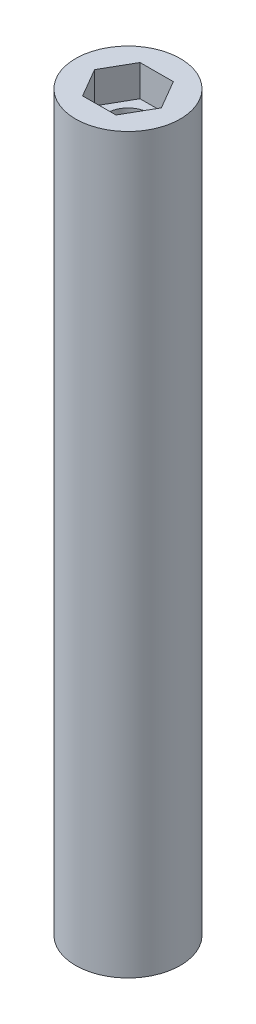
ISO-10303-21;
HEADER;
FILE_DESCRIPTION(('STEP AP214'),'2;1');
FILE_NAME('part.step','',(''),(''),'','','');
FILE_SCHEMA(('AUTOMOTIVE_DESIGN { 1 0 10303 214 1 1 1 1 }'));
ENDSEC;
DATA;
#1=APPLICATION_CONTEXT('core data for automotive mechanical design processes');
#2=APPLICATION_PROTOCOL_DEFINITION('international standard','automotive_design',2000,#1);
#3=PRODUCT_CONTEXT('',#1,'mechanical');
#4=PRODUCT('Part','Part','',(#3));
#5=PRODUCT_RELATED_PRODUCT_CATEGORY('part','',(#4));
#6=PRODUCT_DEFINITION_FORMATION('','',#4);
#7=PRODUCT_DEFINITION_CONTEXT('part definition',#1,'design');
#8=PRODUCT_DEFINITION('design','',#6,#7);
#9=PRODUCT_DEFINITION_SHAPE('','',#8);
#10=(LENGTH_UNIT() NAMED_UNIT(*) SI_UNIT(.MILLI.,.METRE.));
#11=(NAMED_UNIT(*) PLANE_ANGLE_UNIT() SI_UNIT($,.RADIAN.));
#12=(NAMED_UNIT(*) SI_UNIT($,.STERADIAN.) SOLID_ANGLE_UNIT());
#13=UNCERTAINTY_MEASURE_WITH_UNIT(LENGTH_MEASURE(1.E-05),#10,'distance_accuracy_value','');
#14=(GEOMETRIC_REPRESENTATION_CONTEXT(3) GLOBAL_UNCERTAINTY_ASSIGNED_CONTEXT((#13)) GLOBAL_UNIT_ASSIGNED_CONTEXT((#10,
#11,#12)) REPRESENTATION_CONTEXT('',''));
#15=CARTESIAN_POINT('',(0.,0.,0.));
#16=DIRECTION('',(0.,0.,1.));
#17=DIRECTION('',(1.,0.,0.));
#18=AXIS2_PLACEMENT_3D('',#15,#16,#17);
#19=CARTESIAN_POINT('',(0.,0.,0.));
#20=DIRECTION('',(0.,1.,0.));
#21=DIRECTION('',(0.,0.,1.));
#22=AXIS2_PLACEMENT_3D('',#19,#20,#21);
#23=CYLINDRICAL_SURFACE('',#22,2.);
#24=CARTESIAN_POINT('',(0.,3.,0.));
#25=DIRECTION('',(0.,1.,0.));
#26=DIRECTION('',(0.,0.,1.));
#27=AXIS2_PLACEMENT_3D('',#24,#25,#26);
#28=CIRCLE('',#27,2.);
#29=CARTESIAN_POINT('',(0.,3.,2.));
#30=VERTEX_POINT('',#29);
#31=EDGE_CURVE('E37',#30,#30,#28,.F.);
#32=ORIENTED_EDGE('',*,*,#31,.T.);
#33=EDGE_LOOP('',(#32));
#34=FACE_BOUND('',#33,.T.);
#35=CARTESIAN_POINT('',(0.,67.,0.));
#36=DIRECTION('',(0.,1.,0.));
#37=DIRECTION('',(0.,0.,1.));
#38=AXIS2_PLACEMENT_3D('',#35,#36,#37);
#39=CIRCLE('',#38,2.);
#40=CARTESIAN_POINT('',(0.,67.,2.));
#41=VERTEX_POINT('',#40);
#42=EDGE_CURVE('E217',#41,#41,#39,.F.);
#43=ORIENTED_EDGE('',*,*,#42,.F.);
#44=EDGE_LOOP('',(#43));
#45=FACE_BOUND('',#44,.T.);
#46=ADVANCED_FACE('F33',(#34,#45),#23,.F.);
#47=CARTESIAN_POINT('',(0.,70.,0.));
#48=DIRECTION('',(0.,-1.,0.));
#49=DIRECTION('',(0.,0.,-1.));
#50=AXIS2_PLACEMENT_3D('',#47,#48,#49);
#51=CYLINDRICAL_SURFACE('',#50,5.);
#52=CARTESIAN_POINT('',(0.,70.,0.));
#53=DIRECTION('',(0.,1.,0.));
#54=DIRECTION('',(0.,0.,1.));
#55=AXIS2_PLACEMENT_3D('',#52,#53,#54);
#56=CIRCLE('',#55,5.);
#57=CARTESIAN_POINT('',(0.,70.,5.));
#58=VERTEX_POINT('',#57);
#59=EDGE_CURVE('E11',#58,#58,#56,.T.);
#60=ORIENTED_EDGE('',*,*,#59,.F.);
#61=EDGE_LOOP('',(#60));
#62=FACE_BOUND('',#61,.T.);
#63=CARTESIAN_POINT('',(0.,0.,0.));
#64=DIRECTION('',(0.,1.,0.));
#65=DIRECTION('',(0.,0.,1.));
#66=AXIS2_PLACEMENT_3D('',#63,#64,#65);
#67=CIRCLE('',#66,5.);
#68=CARTESIAN_POINT('',(0.,0.,5.));
#69=VERTEX_POINT('',#68);
#70=EDGE_CURVE('E42',#69,#69,#67,.T.);
#71=ORIENTED_EDGE('',*,*,#70,.T.);
#72=EDGE_LOOP('',(#71));
#73=FACE_BOUND('',#72,.T.);
#74=ADVANCED_FACE('F35',(#62,#73),#51,.T.);
#75=CARTESIAN_POINT('',(0.,70.,0.));
#76=DIRECTION('',(0.,1.,0.));
#77=DIRECTION('',(0.,0.,1.));
#78=AXIS2_PLACEMENT_3D('',#75,#76,#77);
#79=PLANE('',#78);
#80=DIRECTION('',(0.99999151154788,0.,-0.00412029515770227));
#81=VECTOR('',#80,1.);
#82=CARTESIAN_POINT('',(-1.57636895135997,70.,2.75651850393238));
#83=LINE('',#82,#81);
#84=CARTESIAN_POINT('',(-1.57636895135997,70.,2.75651850393238));
#85=VERTEX_POINT('',#84);
#86=CARTESIAN_POINT('',(1.59903057472733,70.,2.74343480958096));
#87=VERTEX_POINT('',#86);
#88=EDGE_CURVE('E58',#85,#87,#83,.T.);
#89=ORIENTED_EDGE('',*,*,#88,.F.);
#90=DIRECTION('',(0.5035640360516,0.,0.863957904990413));
#91=VECTOR('',#90,1.);
#92=CARTESIAN_POINT('',(-3.1753995260873,70.,0.0130836943514207));
#93=LINE('',#92,#91);
#94=CARTESIAN_POINT('',(-3.1753995260873,70.,0.0130836943514207));
#95=VERTEX_POINT('',#94);
#96=EDGE_CURVE('E184',#95,#85,#93,.T.);
#97=ORIENTED_EDGE('',*,*,#96,.F.);
#98=DIRECTION('',(-0.496427475496279,0.,0.868078200148115));
#99=VECTOR('',#98,1.);
#100=CARTESIAN_POINT('',(-1.59903057472733,70.,-2.74343480958096));
#101=LINE('',#100,#99);
#102=CARTESIAN_POINT('',(-1.59903057472733,70.,-2.74343480958096));
#103=VERTEX_POINT('',#102);
#104=EDGE_CURVE('E210',#103,#95,#101,.T.);
#105=ORIENTED_EDGE('',*,*,#104,.F.);
#106=DIRECTION('',(-0.99999151154788,0.,0.00412029515770227));
#107=VECTOR('',#106,1.);
#108=CARTESIAN_POINT('',(1.57636895135997,70.,-2.75651850393238));
#109=LINE('',#108,#107);
#110=CARTESIAN_POINT('',(1.57636895135997,70.,-2.75651850393238));
#111=VERTEX_POINT('',#110);
#112=EDGE_CURVE('E207',#111,#103,#109,.T.);
#113=ORIENTED_EDGE('',*,*,#112,.F.);
#114=DIRECTION('',(-0.5035640360516,0.,-0.863957904990413));
#115=VECTOR('',#114,1.);
#116=CARTESIAN_POINT('',(3.1753995260873,70.,-0.0130836943514213));
#117=LINE('',#116,#115);
#118=CARTESIAN_POINT('',(3.1753995260873,70.,-0.0130836943514213));
#119=VERTEX_POINT('',#118);
#120=EDGE_CURVE('E204',#119,#111,#117,.T.);
#121=ORIENTED_EDGE('',*,*,#120,.F.);
#122=DIRECTION('',(0.496427475496279,0.,-0.868078200148115));
#123=VECTOR('',#122,1.);
#124=CARTESIAN_POINT('',(1.59903057472733,70.,2.74343480958096));
#125=LINE('',#124,#123);
#126=EDGE_CURVE('E201',#87,#119,#125,.T.);
#127=ORIENTED_EDGE('',*,*,#126,.F.);
#128=EDGE_LOOP('',(#89,#97,#105,#113,#121,#127));
#129=FACE_BOUND('',#128,.T.);
#130=ORIENTED_EDGE('',*,*,#59,.T.);
#131=EDGE_LOOP('',(#130));
#132=FACE_BOUND('',#131,.T.);
#133=ADVANCED_FACE('F239',(#129,#132),#79,.T.);
#134=CARTESIAN_POINT('',(0.,0.,0.));
#135=DIRECTION('',(0.,1.,0.));
#136=DIRECTION('',(0.,0.,1.));
#137=AXIS2_PLACEMENT_3D('',#134,#135,#136);
#138=PLANE('',#137);
#139=DIRECTION('',(0.5035640360516,0.,0.863957904990413));
#140=VECTOR('',#139,1.);
#141=CARTESIAN_POINT('',(-3.1753995260873,0.,0.0130836943514207));
#142=LINE('',#141,#140);
#143=CARTESIAN_POINT('',(-3.1753995260873,0.,0.0130836943514207));
#144=VERTEX_POINT('',#143);
#145=CARTESIAN_POINT('',(-1.57636895135997,0.,2.75651850393238));
#146=VERTEX_POINT('',#145);
#147=EDGE_CURVE('E136',#144,#146,#142,.T.);
#148=ORIENTED_EDGE('',*,*,#147,.T.);
#149=DIRECTION('',(0.99999151154788,0.,-0.00412029515770227));
#150=VECTOR('',#149,1.);
#151=CARTESIAN_POINT('',(-1.57636895135997,0.,2.75651850393238));
#152=LINE('',#151,#150);
#153=CARTESIAN_POINT('',(1.59903057472733,0.,2.74343480958096));
#154=VERTEX_POINT('',#153);
#155=EDGE_CURVE('E128',#146,#154,#152,.T.);
#156=ORIENTED_EDGE('',*,*,#155,.T.);
#157=DIRECTION('',(0.496427475496279,0.,-0.868078200148115));
#158=VECTOR('',#157,1.);
#159=CARTESIAN_POINT('',(1.59903057472733,0.,2.74343480958096));
#160=LINE('',#159,#158);
#161=CARTESIAN_POINT('',(3.1753995260873,0.,-0.0130836943514213));
#162=VERTEX_POINT('',#161);
#163=EDGE_CURVE('E139',#154,#162,#160,.T.);
#164=ORIENTED_EDGE('',*,*,#163,.T.);
#165=DIRECTION('',(-0.5035640360516,0.,-0.863957904990413));
#166=VECTOR('',#165,1.);
#167=CARTESIAN_POINT('',(3.1753995260873,0.,-0.0130836943514213));
#168=LINE('',#167,#166);
#169=CARTESIAN_POINT('',(1.57636895135997,0.,-2.75651850393238));
#170=VERTEX_POINT('',#169);
#171=EDGE_CURVE('E50',#162,#170,#168,.T.);
#172=ORIENTED_EDGE('',*,*,#171,.T.);
#173=DIRECTION('',(-0.99999151154788,0.,0.00412029515770227));
#174=VECTOR('',#173,1.);
#175=CARTESIAN_POINT('',(1.57636895135997,0.,-2.75651850393238));
#176=LINE('',#175,#174);
#177=CARTESIAN_POINT('',(-1.59903057472733,0.,-2.74343480958096));
#178=VERTEX_POINT('',#177);
#179=EDGE_CURVE('E154',#170,#178,#176,.T.);
#180=ORIENTED_EDGE('',*,*,#179,.T.);
#181=DIRECTION('',(-0.496427475496279,0.,0.868078200148115));
#182=VECTOR('',#181,1.);
#183=CARTESIAN_POINT('',(-1.59903057472733,0.,-2.74343480958096));
#184=LINE('',#183,#182);
#185=EDGE_CURVE('E157',#178,#144,#184,.T.);
#186=ORIENTED_EDGE('',*,*,#185,.T.);
#187=EDGE_LOOP('',(#148,#156,#164,#172,#180,#186));
#188=FACE_BOUND('',#187,.T.);
#189=ORIENTED_EDGE('',*,*,#70,.F.);
#190=EDGE_LOOP('',(#189));
#191=FACE_BOUND('',#190,.T.);
#192=ADVANCED_FACE('F143',(#188,#191),#138,.F.);
#193=CARTESIAN_POINT('',(0.,67.,0.));
#194=DIRECTION('',(0.,1.,0.));
#195=DIRECTION('',(0.,0.,1.));
#196=AXIS2_PLACEMENT_3D('',#193,#194,#195);
#197=PLANE('',#196);
#198=DIRECTION('',(0.99999151154788,0.,-0.00412029515770227));
#199=VECTOR('',#198,1.);
#200=CARTESIAN_POINT('',(-1.57636895135997,67.,2.75651850393238));
#201=LINE('',#200,#199);
#202=CARTESIAN_POINT('',(-1.57636895135997,67.,2.75651850393238));
#203=VERTEX_POINT('',#202);
#204=CARTESIAN_POINT('',(1.59903057472733,67.,2.74343480958096));
#205=VERTEX_POINT('',#204);
#206=EDGE_CURVE('E180',#203,#205,#201,.T.);
#207=ORIENTED_EDGE('',*,*,#206,.T.);
#208=DIRECTION('',(0.496427475496279,0.,-0.868078200148115));
#209=VECTOR('',#208,1.);
#210=CARTESIAN_POINT('',(1.59903057472733,67.,2.74343480958096));
#211=LINE('',#210,#209);
#212=CARTESIAN_POINT('',(3.1753995260873,67.,-0.0130836943514213));
#213=VERTEX_POINT('',#212);
#214=EDGE_CURVE('E183',#205,#213,#211,.T.);
#215=ORIENTED_EDGE('',*,*,#214,.T.);
#216=DIRECTION('',(-0.5035640360516,0.,-0.863957904990413));
#217=VECTOR('',#216,1.);
#218=CARTESIAN_POINT('',(3.1753995260873,67.,-0.0130836943514213));
#219=LINE('',#218,#217);
#220=CARTESIAN_POINT('',(1.57636895135997,67.,-2.75651850393238));
#221=VERTEX_POINT('',#220);
#222=EDGE_CURVE('E187',#213,#221,#219,.T.);
#223=ORIENTED_EDGE('',*,*,#222,.T.);
#224=DIRECTION('',(-0.99999151154788,0.,0.00412029515770227));
#225=VECTOR('',#224,1.);
#226=CARTESIAN_POINT('',(1.57636895135997,67.,-2.75651850393238));
#227=LINE('',#226,#225);
#228=CARTESIAN_POINT('',(-1.59903057472733,67.,-2.74343480958096));
#229=VERTEX_POINT('',#228);
#230=EDGE_CURVE('E190',#221,#229,#227,.T.);
#231=ORIENTED_EDGE('',*,*,#230,.T.);
#232=DIRECTION('',(-0.496427475496279,0.,0.868078200148115));
#233=VECTOR('',#232,1.);
#234=CARTESIAN_POINT('',(-1.59903057472733,67.,-2.74343480958096));
#235=LINE('',#234,#233);
#236=CARTESIAN_POINT('',(-3.1753995260873,67.,0.0130836943514207));
#237=VERTEX_POINT('',#236);
#238=EDGE_CURVE('E193',#229,#237,#235,.T.);
#239=ORIENTED_EDGE('',*,*,#238,.T.);
#240=DIRECTION('',(0.5035640360516,0.,0.863957904990413));
#241=VECTOR('',#240,1.);
#242=CARTESIAN_POINT('',(-3.1753995260873,67.,0.0130836943514207));
#243=LINE('',#242,#241);
#244=EDGE_CURVE('E196',#237,#203,#243,.T.);
#245=ORIENTED_EDGE('',*,*,#244,.T.);
#246=EDGE_LOOP('',(#207,#215,#223,#231,#239,#245));
#247=FACE_BOUND('',#246,.T.);
#248=ORIENTED_EDGE('',*,*,#42,.T.);
#249=EDGE_LOOP('',(#248));
#250=FACE_BOUND('',#249,.T.);
#251=ADVANCED_FACE('F231',(#247,#250),#197,.T.);
#252=CARTESIAN_POINT('',(-1.57636895135997,67.,2.75651850393238));
#253=DIRECTION('',(0.00412029515770227,0.,0.99999151154788));
#254=DIRECTION('',(0.99999151154788,0.,-0.00412029515770227));
#255=AXIS2_PLACEMENT_3D('',#252,#253,#254);
#256=PLANE('',#255);
#257=ORIENTED_EDGE('',*,*,#88,.T.);
#258=DIRECTION('',(0.,1.,0.));
#259=VECTOR('',#258,1.);
#260=CARTESIAN_POINT('',(1.59903057472733,67.,2.74343480958096));
#261=LINE('',#260,#259);
#262=EDGE_CURVE('E199',#205,#87,#261,.T.);
#263=ORIENTED_EDGE('',*,*,#262,.F.);
#264=ORIENTED_EDGE('',*,*,#206,.F.);
#265=DIRECTION('',(0.,1.,0.));
#266=VECTOR('',#265,1.);
#267=CARTESIAN_POINT('',(-1.57636895135997,67.,2.75651850393238));
#268=LINE('',#267,#266);
#269=EDGE_CURVE('E215',#203,#85,#268,.T.);
#270=ORIENTED_EDGE('',*,*,#269,.T.);
#271=EDGE_LOOP('',(#257,#263,#264,#270));
#272=FACE_BOUND('',#271,.T.);
#273=ADVANCED_FACE('F244',(#272),#256,.F.);
#274=CARTESIAN_POINT('',(-3.1753995260873,67.,0.0130836943514207));
#275=DIRECTION('',(-0.863957904990413,0.,0.5035640360516));
#276=DIRECTION('',(0.5035640360516,0.,0.863957904990413));
#277=AXIS2_PLACEMENT_3D('',#274,#275,#276);
#278=PLANE('',#277);
#279=ORIENTED_EDGE('',*,*,#96,.T.);
#280=ORIENTED_EDGE('',*,*,#269,.F.);
#281=ORIENTED_EDGE('',*,*,#244,.F.);
#282=DIRECTION('',(0.,1.,0.));
#283=VECTOR('',#282,1.);
#284=CARTESIAN_POINT('',(-3.1753995260873,67.,0.0130836943514207));
#285=LINE('',#284,#283);
#286=EDGE_CURVE('E218',#237,#95,#285,.T.);
#287=ORIENTED_EDGE('',*,*,#286,.T.);
#288=EDGE_LOOP('',(#279,#280,#281,#287));
#289=FACE_BOUND('',#288,.T.);
#290=ADVANCED_FACE('F257',(#289),#278,.F.);
#291=CARTESIAN_POINT('',(-1.59903057472733,67.,-2.74343480958096));
#292=DIRECTION('',(-0.868078200148115,0.,-0.496427475496279));
#293=DIRECTION('',(-0.496427475496279,0.,0.868078200148115));
#294=AXIS2_PLACEMENT_3D('',#291,#292,#293);
#295=PLANE('',#294);
#296=ORIENTED_EDGE('',*,*,#104,.T.);
#297=ORIENTED_EDGE('',*,*,#286,.F.);
#298=ORIENTED_EDGE('',*,*,#238,.F.);
#299=DIRECTION('',(0.,1.,0.));
#300=VECTOR('',#299,1.);
#301=CARTESIAN_POINT('',(-1.59903057472733,67.,-2.74343480958096));
#302=LINE('',#301,#300);
#303=EDGE_CURVE('E220',#229,#103,#302,.T.);
#304=ORIENTED_EDGE('',*,*,#303,.T.);
#305=EDGE_LOOP('',(#296,#297,#298,#304));
#306=FACE_BOUND('',#305,.T.);
#307=ADVANCED_FACE('F263',(#306),#295,.F.);
#308=CARTESIAN_POINT('',(1.57636895135997,67.,-2.75651850393238));
#309=DIRECTION('',(-0.00412029515770227,0.,-0.99999151154788));
#310=DIRECTION('',(-0.99999151154788,0.,0.00412029515770227));
#311=AXIS2_PLACEMENT_3D('',#308,#309,#310);
#312=PLANE('',#311);
#313=ORIENTED_EDGE('',*,*,#112,.T.);
#314=ORIENTED_EDGE('',*,*,#303,.F.);
#315=ORIENTED_EDGE('',*,*,#230,.F.);
#316=DIRECTION('',(0.,1.,0.));
#317=VECTOR('',#316,1.);
#318=CARTESIAN_POINT('',(1.57636895135997,67.,-2.75651850393238));
#319=LINE('',#318,#317);
#320=EDGE_CURVE('E222',#221,#111,#319,.T.);
#321=ORIENTED_EDGE('',*,*,#320,.T.);
#322=EDGE_LOOP('',(#313,#314,#315,#321));
#323=FACE_BOUND('',#322,.T.);
#324=ADVANCED_FACE('F267',(#323),#312,.F.);
#325=CARTESIAN_POINT('',(3.1753995260873,67.,-0.0130836943514213));
#326=DIRECTION('',(0.863957904990413,0.,-0.5035640360516));
#327=DIRECTION('',(-0.5035640360516,0.,-0.863957904990413));
#328=AXIS2_PLACEMENT_3D('',#325,#326,#327);
#329=PLANE('',#328);
#330=ORIENTED_EDGE('',*,*,#120,.T.);
#331=ORIENTED_EDGE('',*,*,#320,.F.);
#332=ORIENTED_EDGE('',*,*,#222,.F.);
#333=DIRECTION('',(0.,1.,0.));
#334=VECTOR('',#333,1.);
#335=CARTESIAN_POINT('',(3.1753995260873,67.,-0.0130836943514213));
#336=LINE('',#335,#334);
#337=EDGE_CURVE('E224',#213,#119,#336,.T.);
#338=ORIENTED_EDGE('',*,*,#337,.T.);
#339=EDGE_LOOP('',(#330,#331,#332,#338));
#340=FACE_BOUND('',#339,.T.);
#341=ADVANCED_FACE('F271',(#340),#329,.F.);
#342=CARTESIAN_POINT('',(1.59903057472733,67.,2.74343480958096));
#343=DIRECTION('',(0.868078200148115,0.,0.496427475496279));
#344=DIRECTION('',(0.496427475496279,0.,-0.868078200148115));
#345=AXIS2_PLACEMENT_3D('',#342,#343,#344);
#346=PLANE('',#345);
#347=ORIENTED_EDGE('',*,*,#126,.T.);
#348=ORIENTED_EDGE('',*,*,#337,.F.);
#349=ORIENTED_EDGE('',*,*,#214,.F.);
#350=ORIENTED_EDGE('',*,*,#262,.T.);
#351=EDGE_LOOP('',(#347,#348,#349,#350));
#352=FACE_BOUND('',#351,.T.);
#353=ADVANCED_FACE('F274',(#352),#346,.F.);
#354=CARTESIAN_POINT('',(0.,3.,0.));
#355=DIRECTION('',(0.,1.,0.));
#356=DIRECTION('',(0.,0.,1.));
#357=AXIS2_PLACEMENT_3D('',#354,#355,#356);
#358=PLANE('',#357);
#359=DIRECTION('',(0.99999151154788,0.,-0.00412029515770227));
#360=VECTOR('',#359,1.);
#361=CARTESIAN_POINT('',(-1.57636895135997,3.,2.75651850393238));
#362=LINE('',#361,#360);
#363=CARTESIAN_POINT('',(-1.57636895135997,3.,2.75651850393238));
#364=VERTEX_POINT('',#363);
#365=CARTESIAN_POINT('',(1.59903057472733,3.,2.74343480958096));
#366=VERTEX_POINT('',#365);
#367=EDGE_CURVE('E131',#364,#366,#362,.T.);
#368=ORIENTED_EDGE('',*,*,#367,.F.);
#369=DIRECTION('',(0.5035640360516,0.,0.863957904990413));
#370=VECTOR('',#369,1.);
#371=CARTESIAN_POINT('',(-3.1753995260873,3.,0.0130836943514207));
#372=LINE('',#371,#370);
#373=CARTESIAN_POINT('',(-3.1753995260873,3.,0.0130836943514207));
#374=VERTEX_POINT('',#373);
#375=EDGE_CURVE('E147',#374,#364,#372,.T.);
#376=ORIENTED_EDGE('',*,*,#375,.F.);
#377=DIRECTION('',(-0.496427475496279,0.,0.868078200148115));
#378=VECTOR('',#377,1.);
#379=CARTESIAN_POINT('',(-1.59903057472733,3.,-2.74343480958096));
#380=LINE('',#379,#378);
#381=CARTESIAN_POINT('',(-1.59903057472733,3.,-2.74343480958096));
#382=VERTEX_POINT('',#381);
#383=EDGE_CURVE('E150',#382,#374,#380,.T.);
#384=ORIENTED_EDGE('',*,*,#383,.F.);
#385=DIRECTION('',(-0.99999151154788,0.,0.00412029515770227));
#386=VECTOR('',#385,1.);
#387=CARTESIAN_POINT('',(1.57636895135997,3.,-2.75651850393238));
#388=LINE('',#387,#386);
#389=CARTESIAN_POINT('',(1.57636895135997,3.,-2.75651850393238));
#390=VERTEX_POINT('',#389);
#391=EDGE_CURVE('E166',#390,#382,#388,.T.);
#392=ORIENTED_EDGE('',*,*,#391,.F.);
#393=DIRECTION('',(-0.5035640360516,0.,-0.863957904990413));
#394=VECTOR('',#393,1.);
#395=CARTESIAN_POINT('',(3.1753995260873,3.,-0.0130836943514213));
#396=LINE('',#395,#394);
#397=CARTESIAN_POINT('',(3.1753995260873,3.,-0.0130836943514213));
#398=VERTEX_POINT('',#397);
#399=EDGE_CURVE('E163',#398,#390,#396,.T.);
#400=ORIENTED_EDGE('',*,*,#399,.F.);
#401=DIRECTION('',(0.496427475496279,0.,-0.868078200148115));
#402=VECTOR('',#401,1.);
#403=CARTESIAN_POINT('',(1.59903057472733,3.,2.74343480958096));
#404=LINE('',#403,#402);
#405=EDGE_CURVE('E161',#366,#398,#404,.T.);
#406=ORIENTED_EDGE('',*,*,#405,.F.);
#407=EDGE_LOOP('',(#368,#376,#384,#392,#400,#406));
#408=FACE_BOUND('',#407,.T.);
#409=ORIENTED_EDGE('',*,*,#31,.F.);
#410=EDGE_LOOP('',(#409));
#411=FACE_BOUND('',#410,.T.);
#412=ADVANCED_FACE('F277',(#408,#411),#358,.F.);
#413=CARTESIAN_POINT('',(-1.57636895135997,0.,2.75651850393238));
#414=DIRECTION('',(0.00412029515770227,0.,0.99999151154788));
#415=DIRECTION('',(0.99999151154788,0.,-0.00412029515770227));
#416=AXIS2_PLACEMENT_3D('',#413,#414,#415);
#417=PLANE('',#416);
#418=ORIENTED_EDGE('',*,*,#367,.T.);
#419=DIRECTION('',(0.,1.,0.));
#420=VECTOR('',#419,1.);
#421=CARTESIAN_POINT('',(1.59903057472733,0.,2.74343480958096));
#422=LINE('',#421,#420);
#423=EDGE_CURVE('E124',#154,#366,#422,.T.);
#424=ORIENTED_EDGE('',*,*,#423,.F.);
#425=ORIENTED_EDGE('',*,*,#155,.F.);
#426=DIRECTION('',(0.,1.,0.));
#427=VECTOR('',#426,1.);
#428=CARTESIAN_POINT('',(-1.57636895135997,0.,2.75651850393238));
#429=LINE('',#428,#427);
#430=EDGE_CURVE('E171',#146,#364,#429,.T.);
#431=ORIENTED_EDGE('',*,*,#430,.T.);
#432=EDGE_LOOP('',(#418,#424,#425,#431));
#433=FACE_BOUND('',#432,.T.);
#434=ADVANCED_FACE('F126',(#433),#417,.F.);
#435=CARTESIAN_POINT('',(-3.1753995260873,0.,0.0130836943514207));
#436=DIRECTION('',(-0.863957904990413,0.,0.5035640360516));
#437=DIRECTION('',(0.5035640360516,0.,0.863957904990413));
#438=AXIS2_PLACEMENT_3D('',#435,#436,#437);
#439=PLANE('',#438);
#440=ORIENTED_EDGE('',*,*,#375,.T.);
#441=ORIENTED_EDGE('',*,*,#430,.F.);
#442=ORIENTED_EDGE('',*,*,#147,.F.);
#443=DIRECTION('',(0.,1.,0.));
#444=VECTOR('',#443,1.);
#445=CARTESIAN_POINT('',(-3.1753995260873,0.,0.0130836943514207));
#446=LINE('',#445,#444);
#447=EDGE_CURVE('E173',#144,#374,#446,.T.);
#448=ORIENTED_EDGE('',*,*,#447,.T.);
#449=EDGE_LOOP('',(#440,#441,#442,#448));
#450=FACE_BOUND('',#449,.T.);
#451=ADVANCED_FACE('F302',(#450),#439,.F.);
#452=CARTESIAN_POINT('',(-1.59903057472733,0.,-2.74343480958096));
#453=DIRECTION('',(-0.868078200148115,0.,-0.496427475496279));
#454=DIRECTION('',(-0.496427475496279,0.,0.868078200148115));
#455=AXIS2_PLACEMENT_3D('',#452,#453,#454);
#456=PLANE('',#455);
#457=ORIENTED_EDGE('',*,*,#383,.T.);
#458=ORIENTED_EDGE('',*,*,#447,.F.);
#459=ORIENTED_EDGE('',*,*,#185,.F.);
#460=DIRECTION('',(0.,1.,0.));
#461=VECTOR('',#460,1.);
#462=CARTESIAN_POINT('',(-1.59903057472733,0.,-2.74343480958096));
#463=LINE('',#462,#461);
#464=EDGE_CURVE('E175',#178,#382,#463,.T.);
#465=ORIENTED_EDGE('',*,*,#464,.T.);
#466=EDGE_LOOP('',(#457,#458,#459,#465));
#467=FACE_BOUND('',#466,.T.);
#468=ADVANCED_FACE('F307',(#467),#456,.F.);
#469=CARTESIAN_POINT('',(1.57636895135997,0.,-2.75651850393238));
#470=DIRECTION('',(-0.00412029515770227,0.,-0.99999151154788));
#471=DIRECTION('',(-0.99999151154788,0.,0.00412029515770227));
#472=AXIS2_PLACEMENT_3D('',#469,#470,#471);
#473=PLANE('',#472);
#474=ORIENTED_EDGE('',*,*,#391,.T.);
#475=ORIENTED_EDGE('',*,*,#464,.F.);
#476=ORIENTED_EDGE('',*,*,#179,.F.);
#477=DIRECTION('',(0.,1.,0.));
#478=VECTOR('',#477,1.);
#479=CARTESIAN_POINT('',(1.57636895135997,0.,-2.75651850393238));
#480=LINE('',#479,#478);
#481=EDGE_CURVE('E177',#170,#390,#480,.T.);
#482=ORIENTED_EDGE('',*,*,#481,.T.);
#483=EDGE_LOOP('',(#474,#475,#476,#482));
#484=FACE_BOUND('',#483,.T.);
#485=ADVANCED_FACE('F311',(#484),#473,.F.);
#486=CARTESIAN_POINT('',(3.1753995260873,0.,-0.0130836943514213));
#487=DIRECTION('',(0.863957904990413,0.,-0.5035640360516));
#488=DIRECTION('',(-0.5035640360516,0.,-0.863957904990413));
#489=AXIS2_PLACEMENT_3D('',#486,#487,#488);
#490=PLANE('',#489);
#491=ORIENTED_EDGE('',*,*,#399,.T.);
#492=ORIENTED_EDGE('',*,*,#481,.F.);
#493=ORIENTED_EDGE('',*,*,#171,.F.);
#494=DIRECTION('',(0.,1.,0.));
#495=VECTOR('',#494,1.);
#496=CARTESIAN_POINT('',(3.1753995260873,0.,-0.0130836943514213));
#497=LINE('',#496,#495);
#498=EDGE_CURVE('E135',#162,#398,#497,.T.);
#499=ORIENTED_EDGE('',*,*,#498,.T.);
#500=EDGE_LOOP('',(#491,#492,#493,#499));
#501=FACE_BOUND('',#500,.T.);
#502=ADVANCED_FACE('F315',(#501),#490,.F.);
#503=CARTESIAN_POINT('',(1.59903057472733,0.,2.74343480958096));
#504=DIRECTION('',(0.868078200148115,0.,0.496427475496279));
#505=DIRECTION('',(0.496427475496279,0.,-0.868078200148115));
#506=AXIS2_PLACEMENT_3D('',#503,#504,#505);
#507=PLANE('',#506);
#508=ORIENTED_EDGE('',*,*,#405,.T.);
#509=ORIENTED_EDGE('',*,*,#498,.F.);
#510=ORIENTED_EDGE('',*,*,#163,.F.);
#511=ORIENTED_EDGE('',*,*,#423,.T.);
#512=EDGE_LOOP('',(#508,#509,#510,#511));
#513=FACE_BOUND('',#512,.T.);
#514=ADVANCED_FACE('F140',(#513),#507,.F.);
#515=CLOSED_SHELL('',(#46,#74,#133,#192,#251,#273,#290,#307,#324,#341,#353,#412,#434,#451,#468,
#485,#502,#514));
#516=MANIFOLD_SOLID_BREP('B2',#515);
#517=ADVANCED_BREP_SHAPE_REPRESENTATION('',(#18,#516),#14);
#518=SHAPE_DEFINITION_REPRESENTATION(#9,#517);
ENDSEC;
END-ISO-10303-21;
